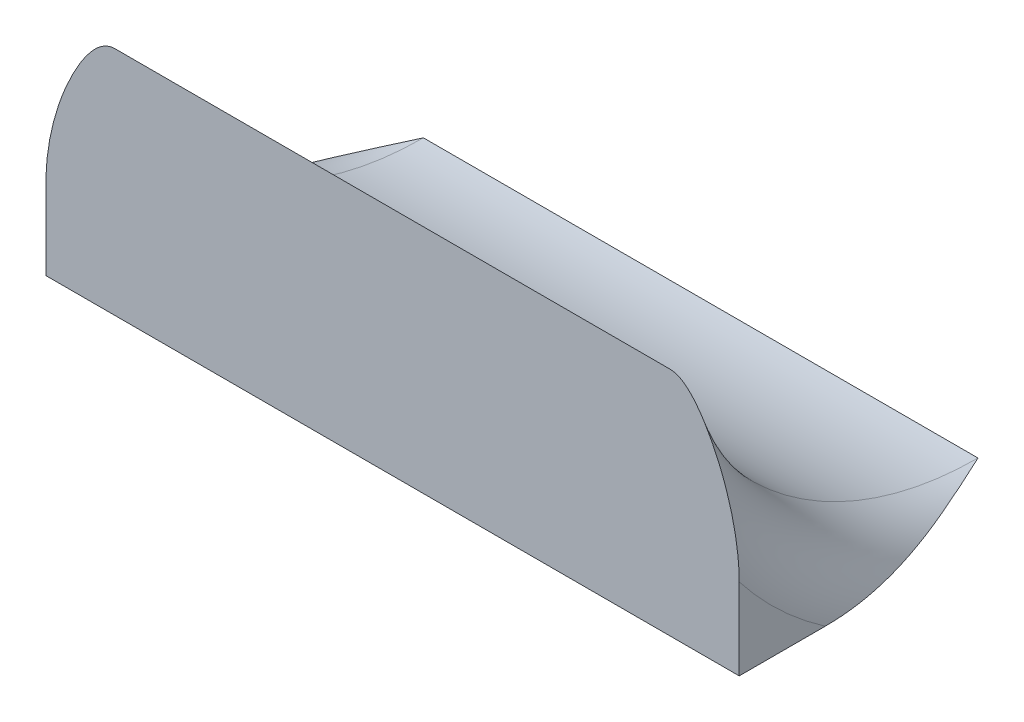
ISO-10303-21;
HEADER;
FILE_DESCRIPTION(('STEP AP214'),'2;1');
FILE_NAME('part.step','',(''),(''),'','','');
FILE_SCHEMA(('AUTOMOTIVE_DESIGN { 1 0 10303 214 1 1 1 1 }'));
ENDSEC;
DATA;
#1=APPLICATION_CONTEXT('core data for automotive mechanical design processes');
#2=APPLICATION_PROTOCOL_DEFINITION('international standard','automotive_design',2000,#1);
#3=PRODUCT_CONTEXT('',#1,'mechanical');
#4=PRODUCT('Part','Part','',(#3));
#5=PRODUCT_RELATED_PRODUCT_CATEGORY('part','',(#4));
#6=PRODUCT_DEFINITION_FORMATION('','',#4);
#7=PRODUCT_DEFINITION_CONTEXT('part definition',#1,'design');
#8=PRODUCT_DEFINITION('design','',#6,#7);
#9=PRODUCT_DEFINITION_SHAPE('','',#8);
#10=(LENGTH_UNIT() NAMED_UNIT(*) SI_UNIT(.MILLI.,.METRE.));
#11=(NAMED_UNIT(*) PLANE_ANGLE_UNIT() SI_UNIT($,.RADIAN.));
#12=(NAMED_UNIT(*) SI_UNIT($,.STERADIAN.) SOLID_ANGLE_UNIT());
#13=UNCERTAINTY_MEASURE_WITH_UNIT(LENGTH_MEASURE(1.E-05),#10,'distance_accuracy_value','');
#14=(GEOMETRIC_REPRESENTATION_CONTEXT(3) GLOBAL_UNCERTAINTY_ASSIGNED_CONTEXT((#13)) GLOBAL_UNIT_ASSIGNED_CONTEXT((#10,
#11,#12)) REPRESENTATION_CONTEXT('',''));
#15=CARTESIAN_POINT('',(0.,0.,0.));
#16=DIRECTION('',(0.,0.,1.));
#17=DIRECTION('',(1.,0.,0.));
#18=AXIS2_PLACEMENT_3D('',#15,#16,#17);
#19=CARTESIAN_POINT('',(5.34,2.81666666667,-7.4));
#20=DIRECTION('',(-1.,0.,0.));
#21=DIRECTION('',(0.,-1.,0.));
#22=AXIS2_PLACEMENT_3D('',#19,#20,#21);
#23=TOROIDAL_SURFACE('',#22,0.506666666666999,0.0899999999999998);
#24=CARTESIAN_POINT('',(5.25,2.4,-7.11172929389331));
#25=CARTESIAN_POINT('',(5.25000817157182,2.39999999999996,-7.12226420750382));
#26=CARTESIAN_POINT('',(5.25059717566563,2.39999999999998,-7.13277700192457));
#27=CARTESIAN_POINT('',(5.25273400888539,2.40000000000002,-7.15367604192474));
#28=CARTESIAN_POINT('',(5.2542789782392,2.40000000000004,-7.16406257107874));
#29=CARTESIAN_POINT('',(5.26000691390942,2.39999999999992,-7.19476484291109));
#30=CARTESIAN_POINT('',(5.26529255207568,2.39999999999959,-7.21486900485835));
#31=CARTESIAN_POINT('',(5.28025199484825,2.40000000000058,-7.26244598700283));
#32=CARTESIAN_POINT('',(5.29083593166103,2.40000000000261,-7.28961338372368));
#33=CARTESIAN_POINT('',(5.313691090384,2.39999999999738,-7.34329374460433));
#34=CARTESIAN_POINT('',(5.32596820399615,2.39999999999008,-7.36980402462252));
#35=CARTESIAN_POINT('',(5.33885292601175,2.40000000000046,-7.39753187914524));
#36=CARTESIAN_POINT('',(5.33942646614134,2.40000000000096,-7.39876593924195));
#37=CARTESIAN_POINT('',(5.34,2.4000000000015,-7.4));
#38=B_SPLINE_CURVE_WITH_KNOTS('',3,(#24,#25,#26,#27,#28,#29,#30,#31,#32,#33,#34,#35,#36,#37),
.UNSPECIFIED.,.F.,.F.,(4,2,2,2,2,2,4),(0.,0.0315568764344396,0.0630198037861172,
0.125216483289172,0.212547910956121,0.300191273586356,0.304273756561997),.UNSPECIFIED.);
#39=CARTESIAN_POINT('',(5.25,2.4,-7.11172929389478));
#40=VERTEX_POINT('',#39);
#41=CARTESIAN_POINT('',(5.34,2.4000000000015,-7.4));
#42=VERTEX_POINT('',#41);
#43=EDGE_CURVE('E67',#40,#42,#38,.T.);
#44=ORIENTED_EDGE('',*,*,#43,.F.);
#45=CARTESIAN_POINT('',(5.25,2.81666666667,-7.4));
#46=DIRECTION('',(-1.,0.,0.));
#47=DIRECTION('',(0.,-1.,0.));
#48=AXIS2_PLACEMENT_3D('',#45,#46,#47);
#49=CIRCLE('',#48,0.506666666666999);
#50=CARTESIAN_POINT('',(5.25,2.50568256561052,-7.));
#51=VERTEX_POINT('',#50);
#52=EDGE_CURVE('E21',#51,#40,#49,.F.);
#53=ORIENTED_EDGE('',*,*,#52,.F.);
#54=CARTESIAN_POINT('',(5.34,2.70000000000214,-7.));
#55=CARTESIAN_POINT('',(5.33820255979553,2.7000075771328,-7.));
#56=CARTESIAN_POINT('',(5.33641802016421,2.69980798632065,-7.));
#57=CARTESIAN_POINT('',(5.33295402144102,2.699072989576,-7.));
#58=CARTESIAN_POINT('',(5.33127318943096,2.69854423143738,-7.));
#59=CARTESIAN_POINT('',(5.32751190526441,2.69701692331311,-7.));
#60=CARTESIAN_POINT('',(5.32547160041114,2.69592301215077,-7.));
#61=CARTESIAN_POINT('',(5.32156952362004,2.69343144776709,-7.));
#62=CARTESIAN_POINT('',(5.31970949361494,2.69203118930512,-7.));
#63=CARTESIAN_POINT('',(5.31343589457283,2.68676409407979,-7.));
#64=CARTESIAN_POINT('',(5.30945631908827,2.6823935945363,-7.));
#65=CARTESIAN_POINT('',(5.3021104792765,2.67317374750964,-7.));
#66=CARTESIAN_POINT('',(5.29874777403987,2.66832185570115,-7.));
#67=CARTESIAN_POINT('',(5.2911730005428,2.65632379313363,-7.));
#68=CARTESIAN_POINT('',(5.28716940755815,2.64904505642376,-7.));
#69=CARTESIAN_POINT('',(5.27978675279657,2.6341745877963,-7.));
#70=CARTESIAN_POINT('',(5.27640881877296,2.62658232028016,-7.));
#71=CARTESIAN_POINT('',(5.26713104815477,2.60350113412844,-7.));
#72=CARTESIAN_POINT('',(5.26206245620279,2.58766522810044,-7.));
#73=CARTESIAN_POINT('',(5.25561305223066,2.56074361951249,-7.));
#74=CARTESIAN_POINT('',(5.25356728699429,2.54981414093923,-7.));
#75=CARTESIAN_POINT('',(5.25076938935914,2.52782794807599,-7.));
#76=CARTESIAN_POINT('',(5.25001338863476,2.51677171473731,-7.));
#77=CARTESIAN_POINT('',(5.25,2.50568256561058,-7.));
#78=B_SPLINE_CURVE_WITH_KNOTS('',3,(#54,#55,#56,#57,#58,#59,#60,#61,#62,#63,#64,#65,#66,#67,#68,
#69,#70,#71,#72,#73,#74,#75,#76,#77),.UNSPECIFIED.,.F.,.F.,(4,2,2,2,2,2,2,2,2,2,2,4),(0.,
0.00536075382320547,0.0106166062475381,0.0175220325716489,0.0244886399425494,0.042084699303784,
0.0597792898738572,0.0846486742987664,0.109562458701924,0.159243487630326,0.192536219053455,
0.225728920570608),.UNSPECIFIED.);
#79=CARTESIAN_POINT('',(5.34,2.70000000000162,-6.99999999999984));
#80=VERTEX_POINT('',#79);
#81=EDGE_CURVE('E64',#80,#51,#78,.T.);
#82=ORIENTED_EDGE('',*,*,#81,.F.);
#83=CARTESIAN_POINT('',(5.34,2.81666666667213,-7.4000000000016));
#84=DIRECTION('',(-1.,0.,0.));
#85=DIRECTION('',(0.,0.,1.));
#86=AXIS2_PLACEMENT_3D('',#83,#84,#85);
#87=CIRCLE('',#86,0.416666666669131);
#88=EDGE_CURVE('E71',#42,#80,#87,.T.);
#89=ORIENTED_EDGE('',*,*,#88,.F.);
#90=EDGE_LOOP('',(#44,#53,#82,#89));
#91=FACE_BOUND('',#90,.T.);
#92=ADVANCED_FACE('F17',(#91),#23,.T.);
#93=CARTESIAN_POINT('',(5.25,2.399,-7.11272929389202));
#94=DIRECTION('',(-1.,0.,0.));
#95=DIRECTION('',(0.,0.,1.));
#96=AXIS2_PLACEMENT_3D('',#93,#94,#95);
#97=PLANE('',#96);
#98=DIRECTION('',(0.,-1.,0.));
#99=VECTOR('',#98,1.);
#100=CARTESIAN_POINT('',(5.25,2.55000000000107,-7.));
#101=LINE('',#100,#99);
#102=CARTESIAN_POINT('',(5.25,2.4,-7.));
#103=VERTEX_POINT('',#102);
#104=EDGE_CURVE('E73',#51,#103,#101,.T.);
#105=ORIENTED_EDGE('',*,*,#104,.F.);
#106=ORIENTED_EDGE('',*,*,#52,.T.);
#107=DIRECTION('',(0.,0.,-1.));
#108=VECTOR('',#107,1.);
#109=CARTESIAN_POINT('',(5.25,2.4,-7.2));
#110=LINE('',#109,#108);
#111=EDGE_CURVE('E75',#103,#40,#110,.T.);
#112=ORIENTED_EDGE('',*,*,#111,.F.);
#113=EDGE_LOOP('',(#105,#106,#112));
#114=FACE_BOUND('',#113,.T.);
#115=ADVANCED_FACE('F74',(#114),#97,.T.);
#116=CARTESIAN_POINT('',(5.34,2.81666666667213,-7.4000000000016));
#117=DIRECTION('',(1.,0.,0.));
#118=DIRECTION('',(0.,0.,-1.));
#119=AXIS2_PLACEMENT_3D('',#116,#117,#118);
#120=CYLINDRICAL_SURFACE('',#119,0.416666666669131);
#121=CARTESIAN_POINT('',(6.06,2.81666666666999,-7.4));
#122=DIRECTION('',(-1.,0.,0.));
#123=DIRECTION('',(0.,0.,1.));
#124=AXIS2_PLACEMENT_3D('',#121,#122,#123);
#125=CIRCLE('',#124,0.416666666666996);
#126=CARTESIAN_POINT('',(6.06,2.4000000000015,-7.4));
#127=VERTEX_POINT('',#126);
#128=CARTESIAN_POINT('',(6.06,2.70000000000107,-7.));
#129=VERTEX_POINT('',#128);
#130=EDGE_CURVE('E122',#127,#129,#125,.T.);
#131=ORIENTED_EDGE('',*,*,#130,.F.);
#132=DIRECTION('',(1.,0.,0.));
#133=VECTOR('',#132,1.);
#134=CARTESIAN_POINT('',(5.69999999999946,2.4,-7.4));
#135=LINE('',#134,#133);
#136=EDGE_CURVE('E82',#42,#127,#135,.T.);
#137=ORIENTED_EDGE('',*,*,#136,.F.);
#138=ORIENTED_EDGE('',*,*,#88,.T.);
#139=DIRECTION('',(-1.,0.,0.));
#140=VECTOR('',#139,1.);
#141=CARTESIAN_POINT('',(5.70000000000005,2.7,-7.));
#142=LINE('',#141,#140);
#143=EDGE_CURVE('E78',#129,#80,#142,.T.);
#144=ORIENTED_EDGE('',*,*,#143,.F.);
#145=EDGE_LOOP('',(#131,#137,#138,#144));
#146=FACE_BOUND('',#145,.T.);
#147=ADVANCED_FACE('F102',(#146),#120,.F.);
#148=CARTESIAN_POINT('',(5.2489999999999,2.399,-7.));
#149=DIRECTION('',(0.,0.,1.));
#150=DIRECTION('',(1.,0.,0.));
#151=AXIS2_PLACEMENT_3D('',#148,#149,#150);
#152=PLANE('',#151);
#153=ORIENTED_EDGE('',*,*,#143,.T.);
#154=ORIENTED_EDGE('',*,*,#81,.T.);
#155=ORIENTED_EDGE('',*,*,#104,.T.);
#156=DIRECTION('',(-1.,0.,0.));
#157=VECTOR('',#156,1.);
#158=CARTESIAN_POINT('',(5.69999999999946,2.4,-7.));
#159=LINE('',#158,#157);
#160=CARTESIAN_POINT('',(6.15,2.4,-7.));
#161=VERTEX_POINT('',#160);
#162=EDGE_CURVE('E133',#161,#103,#159,.T.);
#163=ORIENTED_EDGE('',*,*,#162,.F.);
#164=DIRECTION('',(0.,-1.,0.));
#165=VECTOR('',#164,1.);
#166=CARTESIAN_POINT('',(6.15,2.4528412828052,-7.));
#167=LINE('',#166,#165);
#168=CARTESIAN_POINT('',(6.15,2.50568256561052,-7.));
#169=VERTEX_POINT('',#168);
#170=EDGE_CURVE('E120',#169,#161,#167,.T.);
#171=ORIENTED_EDGE('',*,*,#170,.F.);
#172=CARTESIAN_POINT('',(6.06,2.70000000000214,-7.));
#173=CARTESIAN_POINT('',(6.06179744020447,2.7000075771328,-7.));
#174=CARTESIAN_POINT('',(6.06358197983579,2.69980798632065,-7.));
#175=CARTESIAN_POINT('',(6.06704597855897,2.69907298957599,-7.));
#176=CARTESIAN_POINT('',(6.06872681056904,2.69854423143738,-7.));
#177=CARTESIAN_POINT('',(6.07248809473558,2.69701692331311,-7.));
#178=CARTESIAN_POINT('',(6.07452839958886,2.69592301215077,-7.));
#179=CARTESIAN_POINT('',(6.07843047637995,2.69343144776709,-7.));
#180=CARTESIAN_POINT('',(6.08029050638506,2.69203118930512,-7.));
#181=CARTESIAN_POINT('',(6.08656410542717,2.68676409407978,-7.));
#182=CARTESIAN_POINT('',(6.09054368091172,2.6823935945363,-7.));
#183=CARTESIAN_POINT('',(6.0978895207235,2.67317374750964,-7.));
#184=CARTESIAN_POINT('',(6.10125222596013,2.66832185570115,-7.));
#185=CARTESIAN_POINT('',(6.1088269994572,2.65632379313363,-7.));
#186=CARTESIAN_POINT('',(6.11283059244185,2.64904505642376,-7.));
#187=CARTESIAN_POINT('',(6.12021324720343,2.6341745877963,-7.));
#188=CARTESIAN_POINT('',(6.12359118122704,2.62658232028016,-7.));
#189=CARTESIAN_POINT('',(6.13286895184523,2.60350113412844,-7.));
#190=CARTESIAN_POINT('',(6.1379375437972,2.58766522810044,-7.));
#191=CARTESIAN_POINT('',(6.14438694776934,2.56074361951248,-7.));
#192=CARTESIAN_POINT('',(6.14643271300571,2.54981414093923,-7.));
#193=CARTESIAN_POINT('',(6.14923061064085,2.52782794807599,-7.));
#194=CARTESIAN_POINT('',(6.14998661136524,2.51677171473731,-7.));
#195=CARTESIAN_POINT('',(6.15,2.50568256561058,-7.));
#196=B_SPLINE_CURVE_WITH_KNOTS('',3,(#172,#173,#174,#175,#176,#177,#178,#179,#180,#181,#182,
#183,#184,#185,#186,#187,#188,#189,#190,#191,#192,#193,#194,#195),.UNSPECIFIED.,.F.,.F.,(4,2,2,
2,2,2,2,2,2,2,2,4),(0.,0.00536075382320547,0.0106166062475381,0.0175220325716467,
0.0244886399425488,0.042084699303783,0.0597792898738551,0.0846486742987638,0.109562458701922,
0.159243487630325,0.192536219053453,0.225728920570605),.UNSPECIFIED.);
#197=EDGE_CURVE('E132',#129,#169,#196,.T.);
#198=ORIENTED_EDGE('',*,*,#197,.F.);
#199=EDGE_LOOP('',(#153,#154,#155,#163,#171,#198));
#200=FACE_BOUND('',#199,.T.);
#201=ADVANCED_FACE('F80',(#200),#152,.T.);
#202=CARTESIAN_POINT('',(6.15100000000108,2.4,-6.999));
#203=DIRECTION('',(0.,-1.,0.));
#204=DIRECTION('',(-1.,0.,0.));
#205=AXIS2_PLACEMENT_3D('',#202,#203,#204);
#206=PLANE('',#205);
#207=ORIENTED_EDGE('',*,*,#162,.T.);
#208=ORIENTED_EDGE('',*,*,#111,.T.);
#209=ORIENTED_EDGE('',*,*,#43,.T.);
#210=ORIENTED_EDGE('',*,*,#136,.T.);
#211=CARTESIAN_POINT('',(6.15,2.4,-7.11172929389331));
#212=CARTESIAN_POINT('',(6.14999182842817,2.39999999999996,-7.12226420750386));
#213=CARTESIAN_POINT('',(6.14940282433436,2.39999999999998,-7.13277700192466));
#214=CARTESIAN_POINT('',(6.14726599111459,2.40000000000002,-7.15367604192491));
#215=CARTESIAN_POINT('',(6.14572102176077,2.40000000000004,-7.16406257107896));
#216=CARTESIAN_POINT('',(6.13999308609052,2.39999999999992,-7.19476484291124));
#217=CARTESIAN_POINT('',(6.13470744792423,2.39999999999959,-7.2148690048584));
#218=CARTESIAN_POINT('',(6.11974800515184,2.40000000000058,-7.26244598700285));
#219=CARTESIAN_POINT('',(6.1091640683394,2.40000000000261,-7.28961338372383));
#220=CARTESIAN_POINT('',(6.08630890961559,2.39999999999738,-7.34329374460409));
#221=CARTESIAN_POINT('',(6.07403179600224,2.39999999999008,-7.36980402462175));
#222=CARTESIAN_POINT('',(6.0611470739881,2.40000000000046,-7.39753187914517));
#223=CARTESIAN_POINT('',(6.06057353385859,2.40000000000096,-7.39876593924192));
#224=CARTESIAN_POINT('',(6.06,2.4000000000015,-7.4));
#225=B_SPLINE_CURVE_WITH_KNOTS('',3,(#211,#212,#213,#214,#215,#216,#217,#218,#219,#220,#221,
#222,#223,#224),.UNSPECIFIED.,.F.,.F.,(4,2,2,2,2,2,4),(0.,0.0315568764345816,0.0630198037863676,
0.125216483289168,0.212547910956053,0.300191273586352,0.304273756561993),.UNSPECIFIED.);
#226=CARTESIAN_POINT('',(6.15,2.4,-7.11172929389478));
#227=VERTEX_POINT('',#226);
#228=EDGE_CURVE('E36',#227,#127,#225,.T.);
#229=ORIENTED_EDGE('',*,*,#228,.F.);
#230=DIRECTION('',(0.,0.,-1.));
#231=VECTOR('',#230,1.);
#232=CARTESIAN_POINT('',(6.15,2.4,-7.05586464694601));
#233=LINE('',#232,#231);
#234=EDGE_CURVE('E27',#161,#227,#233,.T.);
#235=ORIENTED_EDGE('',*,*,#234,.F.);
#236=EDGE_LOOP('',(#207,#208,#209,#210,#229,#235));
#237=FACE_BOUND('',#236,.T.);
#238=ADVANCED_FACE('F109',(#237),#206,.T.);
#239=CARTESIAN_POINT('',(6.06,2.81666666666999,-7.4));
#240=DIRECTION('',(1.,0.,0.));
#241=DIRECTION('',(0.,0.,-1.));
#242=AXIS2_PLACEMENT_3D('',#239,#240,#241);
#243=TOROIDAL_SURFACE('',#242,0.506666666666998,0.0899999999999997);
#244=ORIENTED_EDGE('',*,*,#228,.T.);
#245=ORIENTED_EDGE('',*,*,#130,.T.);
#246=ORIENTED_EDGE('',*,*,#197,.T.);
#247=CARTESIAN_POINT('',(6.15,2.81666666666999,-7.4));
#248=DIRECTION('',(1.,0.,0.));
#249=DIRECTION('',(0.,0.,-1.));
#250=AXIS2_PLACEMENT_3D('',#247,#248,#249);
#251=CIRCLE('',#250,0.506666666666992);
#252=EDGE_CURVE('E11',#227,#169,#251,.F.);
#253=ORIENTED_EDGE('',*,*,#252,.F.);
#254=EDGE_LOOP('',(#244,#245,#246,#253));
#255=FACE_BOUND('',#254,.T.);
#256=ADVANCED_FACE('F112',(#255),#243,.T.);
#257=CARTESIAN_POINT('',(6.15,2.399,-6.999));
#258=DIRECTION('',(1.,0.,0.));
#259=DIRECTION('',(0.,0.,-1.));
#260=AXIS2_PLACEMENT_3D('',#257,#258,#259);
#261=PLANE('',#260);
#262=ORIENTED_EDGE('',*,*,#234,.T.);
#263=ORIENTED_EDGE('',*,*,#252,.T.);
#264=ORIENTED_EDGE('',*,*,#170,.T.);
#265=EDGE_LOOP('',(#262,#263,#264));
#266=FACE_BOUND('',#265,.T.);
#267=ADVANCED_FACE('F19',(#266),#261,.T.);
#268=CLOSED_SHELL('',(#92,#115,#147,#201,#238,#256,#267));
#269=MANIFOLD_SOLID_BREP('B1',#268);
#270=ADVANCED_BREP_SHAPE_REPRESENTATION('',(#18,#269),#14);
#271=SHAPE_DEFINITION_REPRESENTATION(#9,#270);
ENDSEC;
END-ISO-10303-21;
